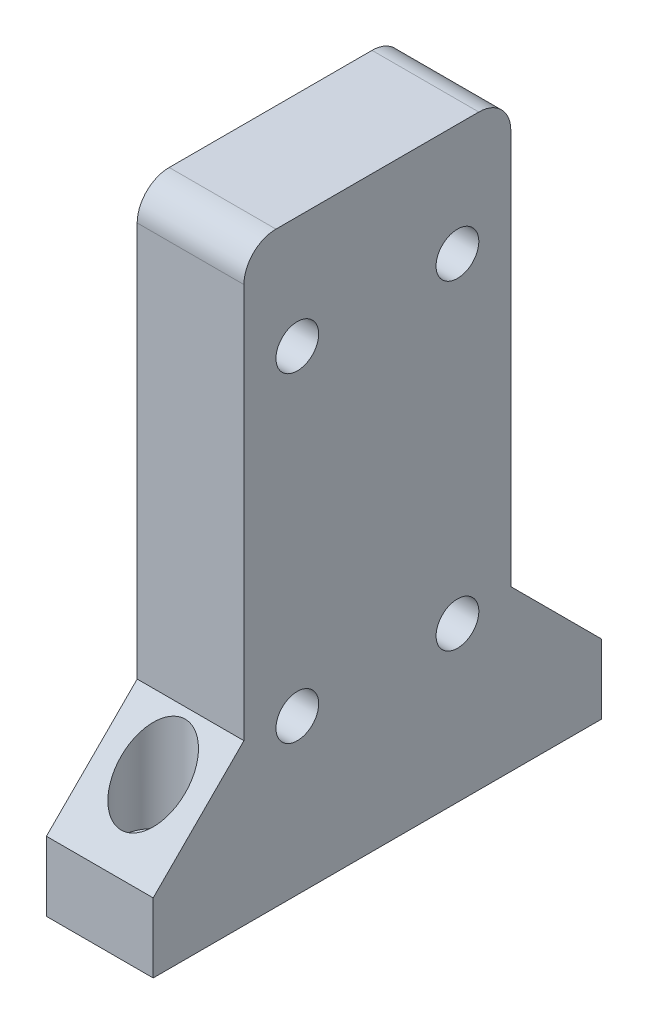
ISO-10303-21;
HEADER;
FILE_DESCRIPTION(('STEP AP214'),'2;1');
FILE_NAME('part.step','',(''),(''),'','','');
FILE_SCHEMA(('AUTOMOTIVE_DESIGN { 1 0 10303 214 1 1 1 1 }'));
ENDSEC;
DATA;
#1=APPLICATION_CONTEXT('core data for automotive mechanical design processes');
#2=APPLICATION_PROTOCOL_DEFINITION('international standard','automotive_design',2000,#1);
#3=PRODUCT_CONTEXT('',#1,'mechanical');
#4=PRODUCT('Part','Part','',(#3));
#5=PRODUCT_RELATED_PRODUCT_CATEGORY('part','',(#4));
#6=PRODUCT_DEFINITION_FORMATION('','',#4);
#7=PRODUCT_DEFINITION_CONTEXT('part definition',#1,'design');
#8=PRODUCT_DEFINITION('design','',#6,#7);
#9=PRODUCT_DEFINITION_SHAPE('','',#8);
#10=(LENGTH_UNIT() NAMED_UNIT(*) SI_UNIT(.MILLI.,.METRE.));
#11=(NAMED_UNIT(*) PLANE_ANGLE_UNIT() SI_UNIT($,.RADIAN.));
#12=(NAMED_UNIT(*) SI_UNIT($,.STERADIAN.) SOLID_ANGLE_UNIT());
#13=UNCERTAINTY_MEASURE_WITH_UNIT(LENGTH_MEASURE(1.E-05),#10,'distance_accuracy_value','');
#14=(GEOMETRIC_REPRESENTATION_CONTEXT(3) GLOBAL_UNCERTAINTY_ASSIGNED_CONTEXT((#13)) GLOBAL_UNIT_ASSIGNED_CONTEXT((#10,
#11,#12)) REPRESENTATION_CONTEXT('',''));
#15=CARTESIAN_POINT('',(0.,0.,0.));
#16=DIRECTION('',(0.,0.,1.));
#17=DIRECTION('',(1.,0.,0.));
#18=AXIS2_PLACEMENT_3D('',#15,#16,#17);
#19=CARTESIAN_POINT('',(0.,0.,-16.));
#20=DIRECTION('',(0.,1.,0.));
#21=DIRECTION('',(0.,0.,1.));
#22=AXIS2_PLACEMENT_3D('',#19,#20,#21);
#23=CYLINDRICAL_SURFACE('',#22,1.75);
#24=CARTESIAN_POINT('',(0.,0.,-16.));
#25=DIRECTION('',(0.,1.,0.));
#26=DIRECTION('',(0.,0.,1.));
#27=AXIS2_PLACEMENT_3D('',#24,#25,#26);
#28=CIRCLE('',#27,1.75);
#29=CARTESIAN_POINT('',(0.,0.,-14.25));
#30=VERTEX_POINT('',#29);
#31=EDGE_CURVE('E352',#30,#30,#28,.T.);
#32=ORIENTED_EDGE('',*,*,#31,.F.);
#33=EDGE_LOOP('',(#32));
#34=FACE_BOUND('',#33,.T.);
#35=CARTESIAN_POINT('',(0.,5.,-16.));
#36=DIRECTION('',(0.,1.,0.));
#37=DIRECTION('',(0.,0.,1.));
#38=AXIS2_PLACEMENT_3D('',#35,#36,#37);
#39=CIRCLE('',#38,1.75);
#40=CARTESIAN_POINT('',(0.,5.,-14.25));
#41=VERTEX_POINT('',#40);
#42=EDGE_CURVE('E177',#41,#41,#39,.F.);
#43=ORIENTED_EDGE('',*,*,#42,.F.);
#44=EDGE_LOOP('',(#43));
#45=FACE_BOUND('',#44,.T.);
#46=ADVANCED_FACE('F37',(#34,#45),#23,.F.);
#47=CARTESIAN_POINT('',(0.,0.,16.));
#48=DIRECTION('',(0.,1.,0.));
#49=DIRECTION('',(0.,0.,1.));
#50=AXIS2_PLACEMENT_3D('',#47,#48,#49);
#51=CYLINDRICAL_SURFACE('',#50,1.75);
#52=CARTESIAN_POINT('',(0.,0.,16.));
#53=DIRECTION('',(0.,1.,0.));
#54=DIRECTION('',(0.,0.,1.));
#55=AXIS2_PLACEMENT_3D('',#52,#53,#54);
#56=CIRCLE('',#55,1.75);
#57=CARTESIAN_POINT('',(0.,0.,17.75));
#58=VERTEX_POINT('',#57);
#59=EDGE_CURVE('E187',#58,#58,#56,.T.);
#60=ORIENTED_EDGE('',*,*,#59,.F.);
#61=EDGE_LOOP('',(#60));
#62=FACE_BOUND('',#61,.T.);
#63=CARTESIAN_POINT('',(0.,5.,16.));
#64=DIRECTION('',(0.,1.,0.));
#65=DIRECTION('',(0.,0.,1.));
#66=AXIS2_PLACEMENT_3D('',#63,#64,#65);
#67=CIRCLE('',#66,1.75);
#68=CARTESIAN_POINT('',(0.,5.,17.75));
#69=VERTEX_POINT('',#68);
#70=EDGE_CURVE('E174',#69,#69,#67,.F.);
#71=ORIENTED_EDGE('',*,*,#70,.F.);
#72=EDGE_LOOP('',(#71));
#73=FACE_BOUND('',#72,.T.);
#74=ADVANCED_FACE('F240',(#62,#73),#51,.F.);
#75=CARTESIAN_POINT('',(5.,3.,-21.));
#76=DIRECTION('',(-1.,0.,0.));
#77=DIRECTION('',(0.,0.,1.));
#78=AXIS2_PLACEMENT_3D('',#75,#76,#77);
#79=PLANE('',#78);
#80=CARTESIAN_POINT('',(5.,14.5,7.49999999999999));
#81=DIRECTION('',(-1.,0.,0.));
#82=DIRECTION('',(0.,0.,1.));
#83=AXIS2_PLACEMENT_3D('',#80,#81,#82);
#84=CIRCLE('',#83,2.);
#85=CARTESIAN_POINT('',(5.,14.5,9.49999999999999));
#86=VERTEX_POINT('',#85);
#87=EDGE_CURVE('E331',#86,#86,#84,.T.);
#88=ORIENTED_EDGE('',*,*,#87,.T.);
#89=EDGE_LOOP('',(#88));
#90=FACE_BOUND('',#89,.T.);
#91=CARTESIAN_POINT('',(5.,44.5,-7.5));
#92=DIRECTION('',(-1.,0.,0.));
#93=DIRECTION('',(0.,0.,1.));
#94=AXIS2_PLACEMENT_3D('',#91,#92,#93);
#95=CIRCLE('',#94,2.);
#96=CARTESIAN_POINT('',(5.,44.5,-5.5));
#97=VERTEX_POINT('',#96);
#98=EDGE_CURVE('E338',#97,#97,#95,.T.);
#99=ORIENTED_EDGE('',*,*,#98,.T.);
#100=EDGE_LOOP('',(#99));
#101=FACE_BOUND('',#100,.T.);
#102=CARTESIAN_POINT('',(5.,44.5,7.5));
#103=DIRECTION('',(-1.,0.,0.));
#104=DIRECTION('',(0.,0.,1.));
#105=AXIS2_PLACEMENT_3D('',#102,#103,#104);
#106=CIRCLE('',#105,2.);
#107=CARTESIAN_POINT('',(5.,44.5,9.5));
#108=VERTEX_POINT('',#107);
#109=EDGE_CURVE('E322',#108,#108,#106,.T.);
#110=ORIENTED_EDGE('',*,*,#109,.T.);
#111=EDGE_LOOP('',(#110));
#112=FACE_BOUND('',#111,.T.);
#113=CARTESIAN_POINT('',(5.,14.5,-7.49999999999999));
#114=DIRECTION('',(-1.,0.,0.));
#115=DIRECTION('',(0.,0.,1.));
#116=AXIS2_PLACEMENT_3D('',#113,#114,#115);
#117=CIRCLE('',#116,2.);
#118=CARTESIAN_POINT('',(5.,14.5,-5.49999999999999));
#119=VERTEX_POINT('',#118);
#120=EDGE_CURVE('E343',#119,#119,#117,.T.);
#121=ORIENTED_EDGE('',*,*,#120,.T.);
#122=EDGE_LOOP('',(#121));
#123=FACE_BOUND('',#122,.T.);
#124=DIRECTION('',(0.,0.,-1.));
#125=VECTOR('',#124,1.);
#126=CARTESIAN_POINT('',(5.,55.,-12.5));
#127=LINE('',#126,#125);
#128=CARTESIAN_POINT('',(5.,55.,9.5));
#129=VERTEX_POINT('',#128);
#130=CARTESIAN_POINT('',(5.,55.,-9.5));
#131=VERTEX_POINT('',#130);
#132=EDGE_CURVE('E210',#129,#131,#127,.T.);
#133=ORIENTED_EDGE('',*,*,#132,.F.);
#134=CARTESIAN_POINT('',(5.,52.,9.5));
#135=DIRECTION('',(-1.,0.,0.));
#136=DIRECTION('',(0.,0.,1.));
#137=AXIS2_PLACEMENT_3D('',#134,#135,#136);
#138=CIRCLE('',#137,3.);
#139=CARTESIAN_POINT('',(5.,52.,12.5));
#140=VERTEX_POINT('',#139);
#141=EDGE_CURVE('E195',#129,#140,#138,.F.);
#142=ORIENTED_EDGE('',*,*,#141,.T.);
#143=DIRECTION('',(0.,-1.,0.));
#144=VECTOR('',#143,1.);
#145=CARTESIAN_POINT('',(5.,55.,12.5));
#146=LINE('',#145,#144);
#147=CARTESIAN_POINT('',(5.,15.0000000000002,12.5));
#148=VERTEX_POINT('',#147);
#149=EDGE_CURVE('E209',#140,#148,#146,.T.);
#150=ORIENTED_EDGE('',*,*,#149,.T.);
#151=DIRECTION('',(0.,-0.707106781186552,0.707106781186544));
#152=VECTOR('',#151,1.);
#153=CARTESIAN_POINT('',(5.,25.75,1.7500000000003));
#154=LINE('',#153,#152);
#155=CARTESIAN_POINT('',(5.,6.50000000000012,21.));
#156=VERTEX_POINT('',#155);
#157=EDGE_CURVE('E159',#148,#156,#154,.T.);
#158=ORIENTED_EDGE('',*,*,#157,.T.);
#159=DIRECTION('',(0.,-1.,0.));
#160=VECTOR('',#159,1.);
#161=CARTESIAN_POINT('',(5.,3.,21.));
#162=LINE('',#161,#160);
#163=CARTESIAN_POINT('',(5.,0.,21.));
#164=VERTEX_POINT('',#163);
#165=EDGE_CURVE('E139',#156,#164,#162,.T.);
#166=ORIENTED_EDGE('',*,*,#165,.T.);
#167=DIRECTION('',(0.,0.,-1.));
#168=VECTOR('',#167,1.);
#169=CARTESIAN_POINT('',(5.,0.,-21.));
#170=LINE('',#169,#168);
#171=CARTESIAN_POINT('',(5.,0.,-21.));
#172=VERTEX_POINT('',#171);
#173=EDGE_CURVE('E119',#164,#172,#170,.T.);
#174=ORIENTED_EDGE('',*,*,#173,.T.);
#175=DIRECTION('',(0.,-1.,0.));
#176=VECTOR('',#175,1.);
#177=CARTESIAN_POINT('',(5.,3.,-21.));
#178=LINE('',#177,#176);
#179=CARTESIAN_POINT('',(5.,6.50000000000012,-21.));
#180=VERTEX_POINT('',#179);
#181=EDGE_CURVE('E125',#180,#172,#178,.T.);
#182=ORIENTED_EDGE('',*,*,#181,.F.);
#183=DIRECTION('',(0.,0.707106781186552,0.707106781186544));
#184=VECTOR('',#183,1.);
#185=CARTESIAN_POINT('',(5.,4.75000000000004,-22.7500000000001));
#186=LINE('',#185,#184);
#187=CARTESIAN_POINT('',(5.,15.0000000000002,-12.5));
#188=VERTEX_POINT('',#187);
#189=EDGE_CURVE('E171',#180,#188,#186,.T.);
#190=ORIENTED_EDGE('',*,*,#189,.T.);
#191=DIRECTION('',(0.,-1.,0.));
#192=VECTOR('',#191,1.);
#193=CARTESIAN_POINT('',(5.,55.,-12.5));
#194=LINE('',#193,#192);
#195=CARTESIAN_POINT('',(5.,52.,-12.5));
#196=VERTEX_POINT('',#195);
#197=EDGE_CURVE('E140',#196,#188,#194,.T.);
#198=ORIENTED_EDGE('',*,*,#197,.F.);
#199=CARTESIAN_POINT('',(5.,52.,-9.5));
#200=DIRECTION('',(-1.,0.,0.));
#201=DIRECTION('',(0.,0.,1.));
#202=AXIS2_PLACEMENT_3D('',#199,#200,#201);
#203=CIRCLE('',#202,3.);
#204=EDGE_CURVE('E193',#196,#131,#203,.F.);
#205=ORIENTED_EDGE('',*,*,#204,.T.);
#206=EDGE_LOOP('',(#133,#142,#150,#158,#166,#174,#182,#190,#198,#205));
#207=FACE_BOUND('',#206,.T.);
#208=ADVANCED_FACE('F137',(#90,#101,#112,#123,#207),#79,.F.);
#209=CARTESIAN_POINT('',(-5.,3.,-21.));
#210=DIRECTION('',(0.,0.,1.));
#211=DIRECTION('',(1.,0.,0.));
#212=AXIS2_PLACEMENT_3D('',#209,#210,#211);
#213=PLANE('',#212);
#214=DIRECTION('',(-1.,0.,0.));
#215=VECTOR('',#214,1.);
#216=CARTESIAN_POINT('',(-5.,0.,-21.));
#217=LINE('',#216,#215);
#218=CARTESIAN_POINT('',(-5.,0.,-21.));
#219=VERTEX_POINT('',#218);
#220=EDGE_CURVE('E114',#172,#219,#217,.T.);
#221=ORIENTED_EDGE('',*,*,#220,.T.);
#222=DIRECTION('',(0.,-1.,0.));
#223=VECTOR('',#222,1.);
#224=CARTESIAN_POINT('',(-5.,3.,-21.));
#225=LINE('',#224,#223);
#226=CARTESIAN_POINT('',(-5.,6.50000000000012,-21.));
#227=VERTEX_POINT('',#226);
#228=EDGE_CURVE('E133',#227,#219,#225,.T.);
#229=ORIENTED_EDGE('',*,*,#228,.F.);
#230=DIRECTION('',(1.,0.,0.));
#231=VECTOR('',#230,1.);
#232=CARTESIAN_POINT('',(-5.,6.50000000000012,-21.));
#233=LINE('',#232,#231);
#234=EDGE_CURVE('E128',#227,#180,#233,.T.);
#235=ORIENTED_EDGE('',*,*,#234,.T.);
#236=ORIENTED_EDGE('',*,*,#181,.T.);
#237=EDGE_LOOP('',(#221,#229,#235,#236));
#238=FACE_BOUND('',#237,.T.);
#239=ADVANCED_FACE('F126',(#238),#213,.F.);
#240=CARTESIAN_POINT('',(-5.,3.,-21.));
#241=DIRECTION('',(1.,0.,0.));
#242=DIRECTION('',(0.,0.,-1.));
#243=AXIS2_PLACEMENT_3D('',#240,#241,#242);
#244=PLANE('',#243);
#245=CARTESIAN_POINT('',(-5.,14.5,7.49999999999999));
#246=DIRECTION('',(-1.,0.,0.));
#247=DIRECTION('',(0.,0.,1.));
#248=AXIS2_PLACEMENT_3D('',#245,#246,#247);
#249=CIRCLE('',#248,2.);
#250=CARTESIAN_POINT('',(-5.,14.5,9.49999999999999));
#251=VERTEX_POINT('',#250);
#252=EDGE_CURVE('E335',#251,#251,#249,.T.);
#253=ORIENTED_EDGE('',*,*,#252,.F.);
#254=EDGE_LOOP('',(#253));
#255=FACE_BOUND('',#254,.T.);
#256=CARTESIAN_POINT('',(-5.,44.5,-7.5));
#257=DIRECTION('',(-1.,0.,0.));
#258=DIRECTION('',(0.,0.,1.));
#259=AXIS2_PLACEMENT_3D('',#256,#257,#258);
#260=CIRCLE('',#259,2.);
#261=CARTESIAN_POINT('',(-5.,44.5,-5.5));
#262=VERTEX_POINT('',#261);
#263=EDGE_CURVE('E328',#262,#262,#260,.T.);
#264=ORIENTED_EDGE('',*,*,#263,.F.);
#265=EDGE_LOOP('',(#264));
#266=FACE_BOUND('',#265,.T.);
#267=CARTESIAN_POINT('',(-5.,44.5,7.5));
#268=DIRECTION('',(-1.,0.,0.));
#269=DIRECTION('',(0.,0.,1.));
#270=AXIS2_PLACEMENT_3D('',#267,#268,#269);
#271=CIRCLE('',#270,2.);
#272=CARTESIAN_POINT('',(-5.,44.5,9.5));
#273=VERTEX_POINT('',#272);
#274=EDGE_CURVE('E325',#273,#273,#271,.T.);
#275=ORIENTED_EDGE('',*,*,#274,.F.);
#276=EDGE_LOOP('',(#275));
#277=FACE_BOUND('',#276,.T.);
#278=CARTESIAN_POINT('',(-5.,14.5,-7.49999999999999));
#279=DIRECTION('',(-1.,0.,0.));
#280=DIRECTION('',(0.,0.,1.));
#281=AXIS2_PLACEMENT_3D('',#278,#279,#280);
#282=CIRCLE('',#281,2.);
#283=CARTESIAN_POINT('',(-5.,14.5,-5.49999999999999));
#284=VERTEX_POINT('',#283);
#285=EDGE_CURVE('E334',#284,#284,#282,.T.);
#286=ORIENTED_EDGE('',*,*,#285,.F.);
#287=EDGE_LOOP('',(#286));
#288=FACE_BOUND('',#287,.T.);
#289=DIRECTION('',(0.,-1.,0.));
#290=VECTOR('',#289,1.);
#291=CARTESIAN_POINT('',(-5.,55.,12.5));
#292=LINE('',#291,#290);
#293=CARTESIAN_POINT('',(-5.,52.,12.5));
#294=VERTEX_POINT('',#293);
#295=CARTESIAN_POINT('',(-5.,15.0000000000002,12.5));
#296=VERTEX_POINT('',#295);
#297=EDGE_CURVE('E202',#294,#296,#292,.T.);
#298=ORIENTED_EDGE('',*,*,#297,.F.);
#299=CARTESIAN_POINT('',(-5.,52.,9.5));
#300=DIRECTION('',(1.,0.,0.));
#301=DIRECTION('',(0.,0.,-1.));
#302=AXIS2_PLACEMENT_3D('',#299,#300,#301);
#303=CIRCLE('',#302,3.);
#304=CARTESIAN_POINT('',(-5.,55.,9.5));
#305=VERTEX_POINT('',#304);
#306=EDGE_CURVE('E45',#294,#305,#303,.F.);
#307=ORIENTED_EDGE('',*,*,#306,.T.);
#308=DIRECTION('',(0.,0.,1.));
#309=VECTOR('',#308,1.);
#310=CARTESIAN_POINT('',(-5.,55.,-12.5));
#311=LINE('',#310,#309);
#312=CARTESIAN_POINT('',(-5.,55.,-9.5));
#313=VERTEX_POINT('',#312);
#314=EDGE_CURVE('E201',#313,#305,#311,.T.);
#315=ORIENTED_EDGE('',*,*,#314,.F.);
#316=CARTESIAN_POINT('',(-5.,52.,-9.5));
#317=DIRECTION('',(1.,0.,0.));
#318=DIRECTION('',(0.,0.,-1.));
#319=AXIS2_PLACEMENT_3D('',#316,#317,#318);
#320=CIRCLE('',#319,3.);
#321=CARTESIAN_POINT('',(-5.,52.,-12.5));
#322=VERTEX_POINT('',#321);
#323=EDGE_CURVE('E52',#313,#322,#320,.F.);
#324=ORIENTED_EDGE('',*,*,#323,.T.);
#325=DIRECTION('',(0.,-1.,0.));
#326=VECTOR('',#325,1.);
#327=CARTESIAN_POINT('',(-5.,55.,-12.5));
#328=LINE('',#327,#326);
#329=CARTESIAN_POINT('',(-5.,15.0000000000002,-12.5));
#330=VERTEX_POINT('',#329);
#331=EDGE_CURVE('E142',#322,#330,#328,.T.);
#332=ORIENTED_EDGE('',*,*,#331,.T.);
#333=DIRECTION('',(0.,-0.707106781186552,-0.707106781186544));
#334=VECTOR('',#333,1.);
#335=CARTESIAN_POINT('',(-5.,4.75000000000004,-22.7500000000001));
#336=LINE('',#335,#334);
#337=EDGE_CURVE('E167',#330,#227,#336,.T.);
#338=ORIENTED_EDGE('',*,*,#337,.T.);
#339=ORIENTED_EDGE('',*,*,#228,.T.);
#340=DIRECTION('',(0.,0.,1.));
#341=VECTOR('',#340,1.);
#342=CARTESIAN_POINT('',(-5.,0.,-21.));
#343=LINE('',#342,#341);
#344=CARTESIAN_POINT('',(-5.,0.,21.));
#345=VERTEX_POINT('',#344);
#346=EDGE_CURVE('E120',#219,#345,#343,.T.);
#347=ORIENTED_EDGE('',*,*,#346,.T.);
#348=DIRECTION('',(0.,-1.,0.));
#349=VECTOR('',#348,1.);
#350=CARTESIAN_POINT('',(-5.,3.,21.));
#351=LINE('',#350,#349);
#352=CARTESIAN_POINT('',(-5.,6.50000000000012,21.));
#353=VERTEX_POINT('',#352);
#354=EDGE_CURVE('E150',#353,#345,#351,.T.);
#355=ORIENTED_EDGE('',*,*,#354,.F.);
#356=DIRECTION('',(0.,0.707106781186552,-0.707106781186544));
#357=VECTOR('',#356,1.);
#358=CARTESIAN_POINT('',(-5.,25.75,1.7500000000003));
#359=LINE('',#358,#357);
#360=EDGE_CURVE('E164',#353,#296,#359,.T.);
#361=ORIENTED_EDGE('',*,*,#360,.T.);
#362=EDGE_LOOP('',(#298,#307,#315,#324,#332,#338,#339,#347,#355,#361));
#363=FACE_BOUND('',#362,.T.);
#364=ADVANCED_FACE('F200',(#255,#266,#277,#288,#363),#244,.F.);
#365=CARTESIAN_POINT('',(-5.,3.,21.));
#366=DIRECTION('',(0.,0.,-1.));
#367=DIRECTION('',(-1.,0.,0.));
#368=AXIS2_PLACEMENT_3D('',#365,#366,#367);
#369=PLANE('',#368);
#370=DIRECTION('',(1.,0.,0.));
#371=VECTOR('',#370,1.);
#372=CARTESIAN_POINT('',(-5.,0.,21.));
#373=LINE('',#372,#371);
#374=EDGE_CURVE('E147',#345,#164,#373,.T.);
#375=ORIENTED_EDGE('',*,*,#374,.T.);
#376=ORIENTED_EDGE('',*,*,#165,.F.);
#377=DIRECTION('',(-1.,0.,0.));
#378=VECTOR('',#377,1.);
#379=CARTESIAN_POINT('',(-5.,6.50000000000012,21.));
#380=LINE('',#379,#378);
#381=EDGE_CURVE('E161',#156,#353,#380,.T.);
#382=ORIENTED_EDGE('',*,*,#381,.T.);
#383=ORIENTED_EDGE('',*,*,#354,.T.);
#384=EDGE_LOOP('',(#375,#376,#382,#383));
#385=FACE_BOUND('',#384,.T.);
#386=ADVANCED_FACE('F263',(#385),#369,.F.);
#387=CARTESIAN_POINT('',(0.,0.,0.));
#388=DIRECTION('',(0.,1.,0.));
#389=DIRECTION('',(0.,0.,1.));
#390=AXIS2_PLACEMENT_3D('',#387,#388,#389);
#391=PLANE('',#390);
#392=ORIENTED_EDGE('',*,*,#31,.T.);
#393=EDGE_LOOP('',(#392));
#394=FACE_BOUND('',#393,.T.);
#395=ORIENTED_EDGE('',*,*,#59,.T.);
#396=EDGE_LOOP('',(#395));
#397=FACE_BOUND('',#396,.T.);
#398=ORIENTED_EDGE('',*,*,#173,.F.);
#399=ORIENTED_EDGE('',*,*,#374,.F.);
#400=ORIENTED_EDGE('',*,*,#346,.F.);
#401=ORIENTED_EDGE('',*,*,#220,.F.);
#402=EDGE_LOOP('',(#398,#399,#400,#401));
#403=FACE_BOUND('',#402,.T.);
#404=ADVANCED_FACE('F116',(#394,#397,#403),#391,.F.);
#405=CARTESIAN_POINT('',(-5.,55.,-12.5));
#406=DIRECTION('',(0.,0.,1.));
#407=DIRECTION('',(1.,0.,0.));
#408=AXIS2_PLACEMENT_3D('',#405,#406,#407);
#409=PLANE('',#408);
#410=ORIENTED_EDGE('',*,*,#331,.F.);
#411=DIRECTION('',(-1.,0.,0.));
#412=VECTOR('',#411,1.);
#413=CARTESIAN_POINT('',(5.,52.,-12.5));
#414=LINE('',#413,#412);
#415=EDGE_CURVE('E12',#322,#196,#414,.F.);
#416=ORIENTED_EDGE('',*,*,#415,.T.);
#417=ORIENTED_EDGE('',*,*,#197,.T.);
#418=DIRECTION('',(-1.,0.,0.));
#419=VECTOR('',#418,1.);
#420=CARTESIAN_POINT('',(-5.,15.0000000000002,-12.5));
#421=LINE('',#420,#419);
#422=EDGE_CURVE('E156',#188,#330,#421,.T.);
#423=ORIENTED_EDGE('',*,*,#422,.T.);
#424=EDGE_LOOP('',(#410,#416,#417,#423));
#425=FACE_BOUND('',#424,.T.);
#426=ADVANCED_FACE('F225',(#425),#409,.F.);
#427=CARTESIAN_POINT('',(-5.,55.,12.5));
#428=DIRECTION('',(0.,0.,-1.));
#429=DIRECTION('',(-1.,0.,0.));
#430=AXIS2_PLACEMENT_3D('',#427,#428,#429);
#431=PLANE('',#430);
#432=ORIENTED_EDGE('',*,*,#149,.F.);
#433=DIRECTION('',(1.,0.,0.));
#434=VECTOR('',#433,1.);
#435=CARTESIAN_POINT('',(-5.,52.,12.5));
#436=LINE('',#435,#434);
#437=EDGE_CURVE('E60',#140,#294,#436,.F.);
#438=ORIENTED_EDGE('',*,*,#437,.T.);
#439=ORIENTED_EDGE('',*,*,#297,.T.);
#440=DIRECTION('',(1.,0.,0.));
#441=VECTOR('',#440,1.);
#442=CARTESIAN_POINT('',(-5.,15.0000000000002,12.5));
#443=LINE('',#442,#441);
#444=EDGE_CURVE('E132',#296,#148,#443,.T.);
#445=ORIENTED_EDGE('',*,*,#444,.T.);
#446=EDGE_LOOP('',(#432,#438,#439,#445));
#447=FACE_BOUND('',#446,.T.);
#448=ADVANCED_FACE('F214',(#447),#431,.F.);
#449=CARTESIAN_POINT('',(0.,55.,0.));
#450=DIRECTION('',(0.,1.,0.));
#451=DIRECTION('',(0.,0.,1.));
#452=AXIS2_PLACEMENT_3D('',#449,#450,#451);
#453=PLANE('',#452);
#454=ORIENTED_EDGE('',*,*,#314,.T.);
#455=DIRECTION('',(1.,0.,0.));
#456=VECTOR('',#455,1.);
#457=CARTESIAN_POINT('',(5.,55.,9.5));
#458=LINE('',#457,#456);
#459=EDGE_CURVE('E190',#305,#129,#458,.T.);
#460=ORIENTED_EDGE('',*,*,#459,.T.);
#461=ORIENTED_EDGE('',*,*,#132,.T.);
#462=DIRECTION('',(-1.,0.,0.));
#463=VECTOR('',#462,1.);
#464=CARTESIAN_POINT('',(-5.,55.,-9.5));
#465=LINE('',#464,#463);
#466=EDGE_CURVE('E173',#131,#313,#465,.T.);
#467=ORIENTED_EDGE('',*,*,#466,.T.);
#468=EDGE_LOOP('',(#454,#460,#461,#467));
#469=FACE_BOUND('',#468,.T.);
#470=ADVANCED_FACE('F206',(#469),#453,.T.);
#471=CARTESIAN_POINT('',(-5.,15.0000000000002,12.5));
#472=DIRECTION('',(0.,-0.707106781186543,-0.707106781186551));
#473=DIRECTION('',(1.,0.,0.));
#474=AXIS2_PLACEMENT_3D('',#471,#472,#473);
#475=PLANE('',#474);
#476=CARTESIAN_POINT('',(0.,11.5000000000002,16.));
#477=DIRECTION('',(0.,-0.707106781186543,-0.707106781186551));
#478=DIRECTION('',(0.,0.707106781186552,-0.707106781186544));
#479=AXIS2_PLACEMENT_3D('',#476,#477,#478);
#480=ELLIPSE('',#479,4.24264068711931,3.);
#481=CARTESIAN_POINT('',(0.,14.5000000000002,13.));
#482=VERTEX_POINT('',#481);
#483=EDGE_CURVE('E184',#482,#482,#480,.T.);
#484=ORIENTED_EDGE('',*,*,#483,.T.);
#485=EDGE_LOOP('',(#484));
#486=FACE_BOUND('',#485,.T.);
#487=ORIENTED_EDGE('',*,*,#360,.F.);
#488=ORIENTED_EDGE('',*,*,#381,.F.);
#489=ORIENTED_EDGE('',*,*,#157,.F.);
#490=ORIENTED_EDGE('',*,*,#444,.F.);
#491=EDGE_LOOP('',(#487,#488,#489,#490));
#492=FACE_BOUND('',#491,.T.);
#493=ADVANCED_FACE('F256',(#486,#492),#475,.F.);
#494=CARTESIAN_POINT('',(-5.,15.0000000000002,-12.5));
#495=DIRECTION('',(0.,-0.707106781186543,0.707106781186551));
#496=DIRECTION('',(-1.,0.,0.));
#497=AXIS2_PLACEMENT_3D('',#494,#495,#496);
#498=PLANE('',#497);
#499=CARTESIAN_POINT('',(0.,11.5000000000002,-16.));
#500=DIRECTION('',(0.,-0.707106781186543,0.707106781186551));
#501=DIRECTION('',(0.,0.707106781186552,0.707106781186544));
#502=AXIS2_PLACEMENT_3D('',#499,#500,#501);
#503=ELLIPSE('',#502,4.24264068711931,3.);
#504=CARTESIAN_POINT('',(0.,14.5000000000002,-13.));
#505=VERTEX_POINT('',#504);
#506=EDGE_CURVE('E181',#505,#505,#503,.T.);
#507=ORIENTED_EDGE('',*,*,#506,.T.);
#508=EDGE_LOOP('',(#507));
#509=FACE_BOUND('',#508,.T.);
#510=ORIENTED_EDGE('',*,*,#189,.F.);
#511=ORIENTED_EDGE('',*,*,#234,.F.);
#512=ORIENTED_EDGE('',*,*,#337,.F.);
#513=ORIENTED_EDGE('',*,*,#422,.F.);
#514=EDGE_LOOP('',(#510,#511,#512,#513));
#515=FACE_BOUND('',#514,.T.);
#516=ADVANCED_FACE('F224',(#509,#515),#498,.F.);
#517=CARTESIAN_POINT('',(0.,-8.48528137423857,16.));
#518=DIRECTION('',(0.,1.,0.));
#519=DIRECTION('',(0.,0.,1.));
#520=AXIS2_PLACEMENT_3D('',#517,#518,#519);
#521=CYLINDRICAL_SURFACE('',#520,3.);
#522=CARTESIAN_POINT('',(0.,5.,16.));
#523=DIRECTION('',(0.,1.,0.));
#524=DIRECTION('',(0.,0.,1.));
#525=AXIS2_PLACEMENT_3D('',#522,#523,#524);
#526=CIRCLE('',#525,3.);
#527=CARTESIAN_POINT('',(0.,5.,19.));
#528=VERTEX_POINT('',#527);
#529=EDGE_CURVE('E346',#528,#528,#526,.F.);
#530=ORIENTED_EDGE('',*,*,#529,.T.);
#531=EDGE_LOOP('',(#530));
#532=FACE_BOUND('',#531,.T.);
#533=ORIENTED_EDGE('',*,*,#483,.F.);
#534=EDGE_LOOP('',(#533));
#535=FACE_BOUND('',#534,.T.);
#536=ADVANCED_FACE('F251',(#532,#535),#521,.F.);
#537=CARTESIAN_POINT('',(0.,5.,0.));
#538=DIRECTION('',(0.,1.,0.));
#539=DIRECTION('',(0.,0.,1.));
#540=AXIS2_PLACEMENT_3D('',#537,#538,#539);
#541=PLANE('',#540);
#542=ORIENTED_EDGE('',*,*,#529,.F.);
#543=EDGE_LOOP('',(#542));
#544=FACE_BOUND('',#543,.T.);
#545=ORIENTED_EDGE('',*,*,#70,.T.);
#546=EDGE_LOOP('',(#545));
#547=FACE_BOUND('',#546,.T.);
#548=ADVANCED_FACE('F290',(#544,#547),#541,.T.);
#549=CARTESIAN_POINT('',(0.,-8.48528137423857,-16.));
#550=DIRECTION('',(0.,1.,0.));
#551=DIRECTION('',(0.,0.,1.));
#552=AXIS2_PLACEMENT_3D('',#549,#550,#551);
#553=CYLINDRICAL_SURFACE('',#552,3.);
#554=CARTESIAN_POINT('',(0.,5.,-16.));
#555=DIRECTION('',(0.,1.,0.));
#556=DIRECTION('',(0.,0.,1.));
#557=AXIS2_PLACEMENT_3D('',#554,#555,#556);
#558=CIRCLE('',#557,3.);
#559=CARTESIAN_POINT('',(0.,5.,-13.));
#560=VERTEX_POINT('',#559);
#561=EDGE_CURVE('E178',#560,#560,#558,.F.);
#562=ORIENTED_EDGE('',*,*,#561,.T.);
#563=EDGE_LOOP('',(#562));
#564=FACE_BOUND('',#563,.T.);
#565=ORIENTED_EDGE('',*,*,#506,.F.);
#566=EDGE_LOOP('',(#565));
#567=FACE_BOUND('',#566,.T.);
#568=ADVANCED_FACE('F294',(#564,#567),#553,.F.);
#569=CARTESIAN_POINT('',(0.,5.,0.));
#570=DIRECTION('',(0.,1.,0.));
#571=DIRECTION('',(0.,0.,1.));
#572=AXIS2_PLACEMENT_3D('',#569,#570,#571);
#573=PLANE('',#572);
#574=ORIENTED_EDGE('',*,*,#561,.F.);
#575=EDGE_LOOP('',(#574));
#576=FACE_BOUND('',#575,.T.);
#577=ORIENTED_EDGE('',*,*,#42,.T.);
#578=EDGE_LOOP('',(#577));
#579=FACE_BOUND('',#578,.T.);
#580=ADVANCED_FACE('F238',(#576,#579),#573,.T.);
#581=CARTESIAN_POINT('',(0.,52.,9.5));
#582=DIRECTION('',(-1.,0.,0.));
#583=DIRECTION('',(0.,0.,1.));
#584=AXIS2_PLACEMENT_3D('',#581,#582,#583);
#585=CYLINDRICAL_SURFACE('',#584,3.);
#586=ORIENTED_EDGE('',*,*,#306,.F.);
#587=ORIENTED_EDGE('',*,*,#437,.F.);
#588=ORIENTED_EDGE('',*,*,#141,.F.);
#589=ORIENTED_EDGE('',*,*,#459,.F.);
#590=EDGE_LOOP('',(#586,#587,#588,#589));
#591=FACE_BOUND('',#590,.T.);
#592=ADVANCED_FACE('F212',(#591),#585,.T.);
#593=CARTESIAN_POINT('',(0.,52.,-9.5));
#594=DIRECTION('',(1.,0.,0.));
#595=DIRECTION('',(0.,0.,-1.));
#596=AXIS2_PLACEMENT_3D('',#593,#594,#595);
#597=CYLINDRICAL_SURFACE('',#596,3.);
#598=ORIENTED_EDGE('',*,*,#204,.F.);
#599=ORIENTED_EDGE('',*,*,#415,.F.);
#600=ORIENTED_EDGE('',*,*,#323,.F.);
#601=ORIENTED_EDGE('',*,*,#466,.F.);
#602=EDGE_LOOP('',(#598,#599,#600,#601));
#603=FACE_BOUND('',#602,.T.);
#604=ADVANCED_FACE('F39',(#603),#597,.T.);
#605=CARTESIAN_POINT('',(5.,14.5,-7.49999999999999));
#606=DIRECTION('',(-1.,0.,0.));
#607=DIRECTION('',(0.,0.,1.));
#608=AXIS2_PLACEMENT_3D('',#605,#606,#607);
#609=CYLINDRICAL_SURFACE('',#608,2.);
#610=ORIENTED_EDGE('',*,*,#120,.F.);
#611=EDGE_LOOP('',(#610));
#612=FACE_BOUND('',#611,.T.);
#613=ORIENTED_EDGE('',*,*,#285,.T.);
#614=EDGE_LOOP('',(#613));
#615=FACE_BOUND('',#614,.T.);
#616=ADVANCED_FACE('F230',(#612,#615),#609,.F.);
#617=CARTESIAN_POINT('',(5.,44.5,7.5));
#618=DIRECTION('',(-1.,0.,0.));
#619=DIRECTION('',(0.,0.,1.));
#620=AXIS2_PLACEMENT_3D('',#617,#618,#619);
#621=CYLINDRICAL_SURFACE('',#620,2.);
#622=ORIENTED_EDGE('',*,*,#109,.F.);
#623=EDGE_LOOP('',(#622));
#624=FACE_BOUND('',#623,.T.);
#625=ORIENTED_EDGE('',*,*,#274,.T.);
#626=EDGE_LOOP('',(#625));
#627=FACE_BOUND('',#626,.T.);
#628=ADVANCED_FACE('F235',(#624,#627),#621,.F.);
#629=CARTESIAN_POINT('',(5.,44.5,-7.5));
#630=DIRECTION('',(-1.,0.,0.));
#631=DIRECTION('',(0.,0.,1.));
#632=AXIS2_PLACEMENT_3D('',#629,#630,#631);
#633=CYLINDRICAL_SURFACE('',#632,2.);
#634=ORIENTED_EDGE('',*,*,#98,.F.);
#635=EDGE_LOOP('',(#634));
#636=FACE_BOUND('',#635,.T.);
#637=ORIENTED_EDGE('',*,*,#263,.T.);
#638=EDGE_LOOP('',(#637));
#639=FACE_BOUND('',#638,.T.);
#640=ADVANCED_FACE('F307',(#636,#639),#633,.F.);
#641=CARTESIAN_POINT('',(5.,14.5,7.49999999999999));
#642=DIRECTION('',(-1.,0.,0.));
#643=DIRECTION('',(0.,0.,1.));
#644=AXIS2_PLACEMENT_3D('',#641,#642,#643);
#645=CYLINDRICAL_SURFACE('',#644,2.);
#646=ORIENTED_EDGE('',*,*,#87,.F.);
#647=EDGE_LOOP('',(#646));
#648=FACE_BOUND('',#647,.T.);
#649=ORIENTED_EDGE('',*,*,#252,.T.);
#650=EDGE_LOOP('',(#649));
#651=FACE_BOUND('',#650,.T.);
#652=ADVANCED_FACE('F310',(#648,#651),#645,.F.);
#653=CLOSED_SHELL('',(#46,#74,#208,#239,#364,#386,#404,#426,#448,#470,#493,#516,#536,#548,#568,
#580,#592,#604,#616,#628,#640,#652));
#654=MANIFOLD_SOLID_BREP('B2',#653);
#655=ADVANCED_BREP_SHAPE_REPRESENTATION('',(#18,#654),#14);
#656=SHAPE_DEFINITION_REPRESENTATION(#9,#655);
ENDSEC;
END-ISO-10303-21;
